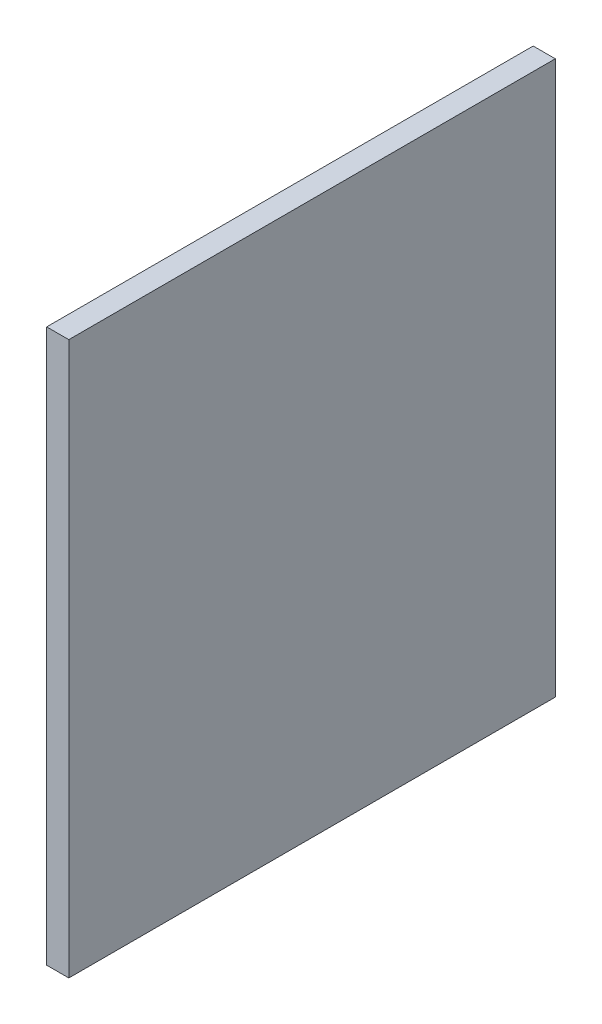
ISO-10303-21;
HEADER;
FILE_DESCRIPTION(('STEP AP214'),'2;1');
FILE_NAME('part.step','',(''),(''),'','','');
FILE_SCHEMA(('AUTOMOTIVE_DESIGN { 1 0 10303 214 1 1 1 1 }'));
ENDSEC;
DATA;
#1=APPLICATION_CONTEXT('core data for automotive mechanical design processes');
#2=APPLICATION_PROTOCOL_DEFINITION('international standard','automotive_design',2000,#1);
#3=PRODUCT_CONTEXT('',#1,'mechanical');
#4=PRODUCT('Part','Part','',(#3));
#5=PRODUCT_RELATED_PRODUCT_CATEGORY('part','',(#4));
#6=PRODUCT_DEFINITION_FORMATION('','',#4);
#7=PRODUCT_DEFINITION_CONTEXT('part definition',#1,'design');
#8=PRODUCT_DEFINITION('design','',#6,#7);
#9=PRODUCT_DEFINITION_SHAPE('','',#8);
#10=(LENGTH_UNIT() NAMED_UNIT(*) SI_UNIT(.MILLI.,.METRE.));
#11=(NAMED_UNIT(*) PLANE_ANGLE_UNIT() SI_UNIT($,.RADIAN.));
#12=(NAMED_UNIT(*) SI_UNIT($,.STERADIAN.) SOLID_ANGLE_UNIT());
#13=UNCERTAINTY_MEASURE_WITH_UNIT(LENGTH_MEASURE(1.E-05),#10,'distance_accuracy_value','');
#14=(GEOMETRIC_REPRESENTATION_CONTEXT(3) GLOBAL_UNCERTAINTY_ASSIGNED_CONTEXT((#13)) GLOBAL_UNIT_ASSIGNED_CONTEXT((#10,
#11,#12)) REPRESENTATION_CONTEXT('',''));
#15=CARTESIAN_POINT('',(0.,0.,0.));
#16=DIRECTION('',(0.,0.,1.));
#17=DIRECTION('',(1.,0.,0.));
#18=AXIS2_PLACEMENT_3D('',#15,#16,#17);
#19=CARTESIAN_POINT('',(20.,-250.,-220.));
#20=DIRECTION('',(0.,0.,1.));
#21=DIRECTION('',(1.,0.,0.));
#22=AXIS2_PLACEMENT_3D('',#19,#20,#21);
#23=PLANE('',#22);
#24=DIRECTION('',(0.,1.,0.));
#25=VECTOR('',#24,1.);
#26=CARTESIAN_POINT('',(0.,-250.,-220.));
#27=LINE('',#26,#25);
#28=CARTESIAN_POINT('',(0.,-250.,-220.));
#29=VERTEX_POINT('',#28);
#30=CARTESIAN_POINT('',(0.,250.,-220.));
#31=VERTEX_POINT('',#30);
#32=EDGE_CURVE('E95',#29,#31,#27,.T.);
#33=ORIENTED_EDGE('',*,*,#32,.T.);
#34=DIRECTION('',(-1.,0.,0.));
#35=VECTOR('',#34,1.);
#36=CARTESIAN_POINT('',(20.,250.,-220.));
#37=LINE('',#36,#35);
#38=CARTESIAN_POINT('',(20.,250.,-220.));
#39=VERTEX_POINT('',#38);
#40=EDGE_CURVE('E11',#39,#31,#37,.T.);
#41=ORIENTED_EDGE('',*,*,#40,.F.);
#42=DIRECTION('',(0.,1.,0.));
#43=VECTOR('',#42,1.);
#44=CARTESIAN_POINT('',(20.,-250.,-220.));
#45=LINE('',#44,#43);
#46=CARTESIAN_POINT('',(20.,-250.,-220.));
#47=VERTEX_POINT('',#46);
#48=EDGE_CURVE('E83',#47,#39,#45,.T.);
#49=ORIENTED_EDGE('',*,*,#48,.F.);
#50=DIRECTION('',(-1.,0.,0.));
#51=VECTOR('',#50,1.);
#52=CARTESIAN_POINT('',(20.,-250.,-220.));
#53=LINE('',#52,#51);
#54=EDGE_CURVE('E91',#47,#29,#53,.T.);
#55=ORIENTED_EDGE('',*,*,#54,.T.);
#56=EDGE_LOOP('',(#33,#41,#49,#55));
#57=FACE_BOUND('',#56,.T.);
#58=ADVANCED_FACE('F32',(#57),#23,.F.);
#59=CARTESIAN_POINT('',(20.,250.,220.));
#60=DIRECTION('',(0.,-1.,0.));
#61=DIRECTION('',(0.,0.,-1.));
#62=AXIS2_PLACEMENT_3D('',#59,#60,#61);
#63=PLANE('',#62);
#64=DIRECTION('',(0.,0.,1.));
#65=VECTOR('',#64,1.);
#66=CARTESIAN_POINT('',(0.,250.,220.));
#67=LINE('',#66,#65);
#68=CARTESIAN_POINT('',(0.,250.,220.));
#69=VERTEX_POINT('',#68);
#70=EDGE_CURVE('E87',#31,#69,#67,.T.);
#71=ORIENTED_EDGE('',*,*,#70,.T.);
#72=DIRECTION('',(-1.,0.,0.));
#73=VECTOR('',#72,1.);
#74=CARTESIAN_POINT('',(20.,250.,220.));
#75=LINE('',#74,#73);
#76=CARTESIAN_POINT('',(20.,250.,220.));
#77=VERTEX_POINT('',#76);
#78=EDGE_CURVE('E40',#77,#69,#75,.T.);
#79=ORIENTED_EDGE('',*,*,#78,.F.);
#80=DIRECTION('',(0.,0.,1.));
#81=VECTOR('',#80,1.);
#82=CARTESIAN_POINT('',(20.,250.,220.));
#83=LINE('',#82,#81);
#84=EDGE_CURVE('E78',#39,#77,#83,.T.);
#85=ORIENTED_EDGE('',*,*,#84,.F.);
#86=ORIENTED_EDGE('',*,*,#40,.T.);
#87=EDGE_LOOP('',(#71,#79,#85,#86));
#88=FACE_BOUND('',#87,.T.);
#89=ADVANCED_FACE('F86',(#88),#63,.F.);
#90=CARTESIAN_POINT('',(20.,-250.,220.));
#91=DIRECTION('',(0.,0.,-1.));
#92=DIRECTION('',(-1.,0.,0.));
#93=AXIS2_PLACEMENT_3D('',#90,#91,#92);
#94=PLANE('',#93);
#95=DIRECTION('',(0.,-1.,0.));
#96=VECTOR('',#95,1.);
#97=CARTESIAN_POINT('',(0.,-250.,220.));
#98=LINE('',#97,#96);
#99=CARTESIAN_POINT('',(0.,-250.,220.));
#100=VERTEX_POINT('',#99);
#101=EDGE_CURVE('E65',#69,#100,#98,.T.);
#102=ORIENTED_EDGE('',*,*,#101,.T.);
#103=DIRECTION('',(-1.,0.,0.));
#104=VECTOR('',#103,1.);
#105=CARTESIAN_POINT('',(20.,-250.,220.));
#106=LINE('',#105,#104);
#107=CARTESIAN_POINT('',(20.,-250.,220.));
#108=VERTEX_POINT('',#107);
#109=EDGE_CURVE('E88',#108,#100,#106,.T.);
#110=ORIENTED_EDGE('',*,*,#109,.F.);
#111=DIRECTION('',(0.,-1.,0.));
#112=VECTOR('',#111,1.);
#113=CARTESIAN_POINT('',(20.,-250.,220.));
#114=LINE('',#113,#112);
#115=EDGE_CURVE('E81',#77,#108,#114,.T.);
#116=ORIENTED_EDGE('',*,*,#115,.F.);
#117=ORIENTED_EDGE('',*,*,#78,.T.);
#118=EDGE_LOOP('',(#102,#110,#116,#117));
#119=FACE_BOUND('',#118,.T.);
#120=ADVANCED_FACE('F89',(#119),#94,.F.);
#121=CARTESIAN_POINT('',(20.,-250.,220.));
#122=DIRECTION('',(0.,1.,0.));
#123=DIRECTION('',(0.,0.,1.));
#124=AXIS2_PLACEMENT_3D('',#121,#122,#123);
#125=PLANE('',#124);
#126=DIRECTION('',(0.,0.,-1.));
#127=VECTOR('',#126,1.);
#128=CARTESIAN_POINT('',(0.,-250.,220.));
#129=LINE('',#128,#127);
#130=EDGE_CURVE('E71',#100,#29,#129,.T.);
#131=ORIENTED_EDGE('',*,*,#130,.T.);
#132=ORIENTED_EDGE('',*,*,#54,.F.);
#133=DIRECTION('',(0.,0.,-1.));
#134=VECTOR('',#133,1.);
#135=CARTESIAN_POINT('',(20.,-250.,220.));
#136=LINE('',#135,#134);
#137=EDGE_CURVE('E48',#108,#47,#136,.T.);
#138=ORIENTED_EDGE('',*,*,#137,.F.);
#139=ORIENTED_EDGE('',*,*,#109,.T.);
#140=EDGE_LOOP('',(#131,#132,#138,#139));
#141=FACE_BOUND('',#140,.T.);
#142=ADVANCED_FACE('F102',(#141),#125,.F.);
#143=CARTESIAN_POINT('',(20.,0.,0.));
#144=DIRECTION('',(-1.,0.,0.));
#145=DIRECTION('',(0.,0.,1.));
#146=AXIS2_PLACEMENT_3D('',#143,#144,#145);
#147=PLANE('',#146);
#148=ORIENTED_EDGE('',*,*,#48,.T.);
#149=ORIENTED_EDGE('',*,*,#84,.T.);
#150=ORIENTED_EDGE('',*,*,#115,.T.);
#151=ORIENTED_EDGE('',*,*,#137,.T.);
#152=EDGE_LOOP('',(#148,#149,#150,#151));
#153=FACE_BOUND('',#152,.T.);
#154=ADVANCED_FACE('F79',(#153),#147,.F.);
#155=CARTESIAN_POINT('',(0.,0.,0.));
#156=DIRECTION('',(-1.,0.,0.));
#157=DIRECTION('',(0.,0.,1.));
#158=AXIS2_PLACEMENT_3D('',#155,#156,#157);
#159=PLANE('',#158);
#160=ORIENTED_EDGE('',*,*,#32,.F.);
#161=ORIENTED_EDGE('',*,*,#130,.F.);
#162=ORIENTED_EDGE('',*,*,#101,.F.);
#163=ORIENTED_EDGE('',*,*,#70,.F.);
#164=EDGE_LOOP('',(#160,#161,#162,#163));
#165=FACE_BOUND('',#164,.T.);
#166=ADVANCED_FACE('F105',(#165),#159,.T.);
#167=CLOSED_SHELL('',(#58,#89,#120,#142,#154,#166));
#168=MANIFOLD_SOLID_BREP('B2',#167);
#169=ADVANCED_BREP_SHAPE_REPRESENTATION('',(#18,#168),#14);
#170=SHAPE_DEFINITION_REPRESENTATION(#9,#169);
ENDSEC;
END-ISO-10303-21;
